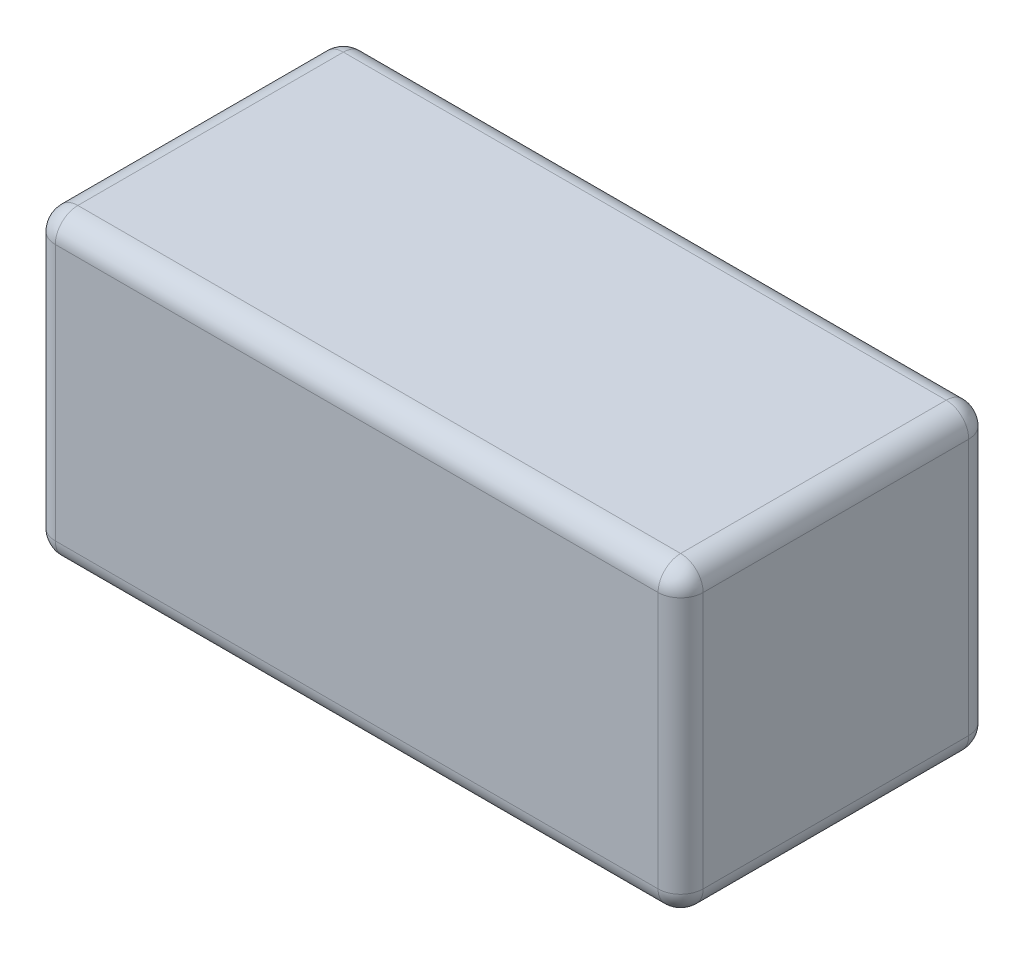
ISO-10303-21;
HEADER;
FILE_DESCRIPTION(('STEP AP214'),'2;1');
FILE_NAME('part.step','',(''),(''),'','','');
FILE_SCHEMA(('AUTOMOTIVE_DESIGN { 1 0 10303 214 1 1 1 1 }'));
ENDSEC;
DATA;
#1=APPLICATION_CONTEXT('core data for automotive mechanical design processes');
#2=APPLICATION_PROTOCOL_DEFINITION('international standard','automotive_design',2000,#1);
#3=PRODUCT_CONTEXT('',#1,'mechanical');
#4=PRODUCT('Part','Part','',(#3));
#5=PRODUCT_RELATED_PRODUCT_CATEGORY('part','',(#4));
#6=PRODUCT_DEFINITION_FORMATION('','',#4);
#7=PRODUCT_DEFINITION_CONTEXT('part definition',#1,'design');
#8=PRODUCT_DEFINITION('design','',#6,#7);
#9=PRODUCT_DEFINITION_SHAPE('','',#8);
#10=(LENGTH_UNIT() NAMED_UNIT(*) SI_UNIT(.MILLI.,.METRE.));
#11=(NAMED_UNIT(*) PLANE_ANGLE_UNIT() SI_UNIT($,.RADIAN.));
#12=(NAMED_UNIT(*) SI_UNIT($,.STERADIAN.) SOLID_ANGLE_UNIT());
#13=UNCERTAINTY_MEASURE_WITH_UNIT(LENGTH_MEASURE(1.E-05),#10,'distance_accuracy_value','');
#14=(GEOMETRIC_REPRESENTATION_CONTEXT(3) GLOBAL_UNCERTAINTY_ASSIGNED_CONTEXT((#13)) GLOBAL_UNIT_ASSIGNED_CONTEXT((#10,
#11,#12)) REPRESENTATION_CONTEXT('',''));
#15=CARTESIAN_POINT('',(0.,0.,0.));
#16=DIRECTION('',(0.,0.,1.));
#17=DIRECTION('',(1.,0.,0.));
#18=AXIS2_PLACEMENT_3D('',#15,#16,#17);
#19=CARTESIAN_POINT('',(-36.5,-17.,35.));
#20=DIRECTION('',(1.,0.,0.));
#21=DIRECTION('',(0.,0.,-1.));
#22=AXIS2_PLACEMENT_3D('',#19,#20,#21);
#23=PLANE('',#22);
#24=DIRECTION('',(0.,0.,-1.));
#25=VECTOR('',#24,1.);
#26=CARTESIAN_POINT('',(-36.5,14.46,35.));
#27=LINE('',#26,#25);
#28=CARTESIAN_POINT('',(-36.5,14.46,32.46));
#29=VERTEX_POINT('',#28);
#30=CARTESIAN_POINT('',(-36.5,14.46,2.54));
#31=VERTEX_POINT('',#30);
#32=EDGE_CURVE('E125',#29,#31,#27,.T.);
#33=ORIENTED_EDGE('',*,*,#32,.T.);
#34=DIRECTION('',(0.,-1.,0.));
#35=VECTOR('',#34,1.);
#36=CARTESIAN_POINT('',(-36.5,-17.,2.54));
#37=LINE('',#36,#35);
#38=CARTESIAN_POINT('',(-36.5,-14.46,2.54));
#39=VERTEX_POINT('',#38);
#40=EDGE_CURVE('E161',#31,#39,#37,.T.);
#41=ORIENTED_EDGE('',*,*,#40,.T.);
#42=DIRECTION('',(0.,0.,-1.));
#43=VECTOR('',#42,1.);
#44=CARTESIAN_POINT('',(-36.5,-14.46,35.));
#45=LINE('',#44,#43);
#46=CARTESIAN_POINT('',(-36.5,-14.46,32.46));
#47=VERTEX_POINT('',#46);
#48=EDGE_CURVE('E128',#39,#47,#45,.F.);
#49=ORIENTED_EDGE('',*,*,#48,.T.);
#50=DIRECTION('',(0.,-1.,0.));
#51=VECTOR('',#50,1.);
#52=CARTESIAN_POINT('',(-36.5,17.,32.46));
#53=LINE('',#52,#51);
#54=EDGE_CURVE('E121',#47,#29,#53,.F.);
#55=ORIENTED_EDGE('',*,*,#54,.T.);
#56=EDGE_LOOP('',(#33,#41,#49,#55));
#57=FACE_BOUND('',#56,.T.);
#58=ADVANCED_FACE('F34',(#57),#23,.F.);
#59=CARTESIAN_POINT('',(36.5,-17.,35.));
#60=DIRECTION('',(0.,1.,0.));
#61=DIRECTION('',(-1.,0.,0.));
#62=AXIS2_PLACEMENT_3D('',#59,#60,#61);
#63=PLANE('',#62);
#64=DIRECTION('',(1.,0.,0.));
#65=VECTOR('',#64,1.);
#66=CARTESIAN_POINT('',(-36.5,-17.,32.46));
#67=LINE('',#66,#65);
#68=CARTESIAN_POINT('',(33.96,-17.,32.46));
#69=VERTEX_POINT('',#68);
#70=CARTESIAN_POINT('',(-33.96,-17.,32.46));
#71=VERTEX_POINT('',#70);
#72=EDGE_CURVE('E172',#69,#71,#67,.F.);
#73=ORIENTED_EDGE('',*,*,#72,.T.);
#74=DIRECTION('',(0.,0.,-1.));
#75=VECTOR('',#74,1.);
#76=CARTESIAN_POINT('',(-33.96,-17.,35.));
#77=LINE('',#76,#75);
#78=CARTESIAN_POINT('',(-33.96,-17.,2.54));
#79=VERTEX_POINT('',#78);
#80=EDGE_CURVE('E178',#71,#79,#77,.T.);
#81=ORIENTED_EDGE('',*,*,#80,.T.);
#82=DIRECTION('',(1.,0.,0.));
#83=VECTOR('',#82,1.);
#84=CARTESIAN_POINT('',(36.5,-17.,2.54));
#85=LINE('',#84,#83);
#86=CARTESIAN_POINT('',(33.96,-17.,2.54));
#87=VERTEX_POINT('',#86);
#88=EDGE_CURVE('E176',#79,#87,#85,.T.);
#89=ORIENTED_EDGE('',*,*,#88,.T.);
#90=DIRECTION('',(0.,0.,-1.));
#91=VECTOR('',#90,1.);
#92=CARTESIAN_POINT('',(33.96,-17.,35.));
#93=LINE('',#92,#91);
#94=EDGE_CURVE('E174',#87,#69,#93,.F.);
#95=ORIENTED_EDGE('',*,*,#94,.T.);
#96=EDGE_LOOP('',(#73,#81,#89,#95));
#97=FACE_BOUND('',#96,.T.);
#98=ADVANCED_FACE('F265',(#97),#63,.F.);
#99=CARTESIAN_POINT('',(36.5,-17.,35.));
#100=DIRECTION('',(-1.,0.,0.));
#101=DIRECTION('',(0.,0.,1.));
#102=AXIS2_PLACEMENT_3D('',#99,#100,#101);
#103=PLANE('',#102);
#104=DIRECTION('',(0.,1.,0.));
#105=VECTOR('',#104,1.);
#106=CARTESIAN_POINT('',(36.5,-17.,32.46));
#107=LINE('',#106,#105);
#108=CARTESIAN_POINT('',(36.5,14.46,32.46));
#109=VERTEX_POINT('',#108);
#110=CARTESIAN_POINT('',(36.5,-14.46,32.46));
#111=VERTEX_POINT('',#110);
#112=EDGE_CURVE('E183',#109,#111,#107,.F.);
#113=ORIENTED_EDGE('',*,*,#112,.T.);
#114=DIRECTION('',(0.,0.,-1.));
#115=VECTOR('',#114,1.);
#116=CARTESIAN_POINT('',(36.5,-14.46,35.));
#117=LINE('',#116,#115);
#118=CARTESIAN_POINT('',(36.5,-14.46,2.54));
#119=VERTEX_POINT('',#118);
#120=EDGE_CURVE('E187',#111,#119,#117,.T.);
#121=ORIENTED_EDGE('',*,*,#120,.T.);
#122=DIRECTION('',(0.,1.,0.));
#123=VECTOR('',#122,1.);
#124=CARTESIAN_POINT('',(36.5,-17.,2.54));
#125=LINE('',#124,#123);
#126=CARTESIAN_POINT('',(36.5,14.46,2.54));
#127=VERTEX_POINT('',#126);
#128=EDGE_CURVE('E185',#119,#127,#125,.T.);
#129=ORIENTED_EDGE('',*,*,#128,.T.);
#130=DIRECTION('',(0.,0.,-1.));
#131=VECTOR('',#130,1.);
#132=CARTESIAN_POINT('',(36.5,14.46,35.));
#133=LINE('',#132,#131);
#134=EDGE_CURVE('E181',#127,#109,#133,.F.);
#135=ORIENTED_EDGE('',*,*,#134,.T.);
#136=EDGE_LOOP('',(#113,#121,#129,#135));
#137=FACE_BOUND('',#136,.T.);
#138=ADVANCED_FACE('F274',(#137),#103,.F.);
#139=CARTESIAN_POINT('',(36.5,17.,35.));
#140=DIRECTION('',(0.,-1.,0.));
#141=DIRECTION('',(1.,0.,0.));
#142=AXIS2_PLACEMENT_3D('',#139,#140,#141);
#143=PLANE('',#142);
#144=DIRECTION('',(-1.,0.,0.));
#145=VECTOR('',#144,1.);
#146=CARTESIAN_POINT('',(36.5,17.,32.46));
#147=LINE('',#146,#145);
#148=CARTESIAN_POINT('',(-33.96,17.,32.46));
#149=VERTEX_POINT('',#148);
#150=CARTESIAN_POINT('',(33.96,17.,32.46));
#151=VERTEX_POINT('',#150);
#152=EDGE_CURVE('E43',#149,#151,#147,.F.);
#153=ORIENTED_EDGE('',*,*,#152,.T.);
#154=DIRECTION('',(0.,0.,-1.));
#155=VECTOR('',#154,1.);
#156=CARTESIAN_POINT('',(33.96,17.,35.));
#157=LINE('',#156,#155);
#158=CARTESIAN_POINT('',(33.96,17.,2.54));
#159=VERTEX_POINT('',#158);
#160=EDGE_CURVE('E11',#151,#159,#157,.T.);
#161=ORIENTED_EDGE('',*,*,#160,.T.);
#162=DIRECTION('',(-1.,0.,0.));
#163=VECTOR('',#162,1.);
#164=CARTESIAN_POINT('',(36.5,17.,2.54));
#165=LINE('',#164,#163);
#166=CARTESIAN_POINT('',(-33.96,17.,2.54));
#167=VERTEX_POINT('',#166);
#168=EDGE_CURVE('E198',#159,#167,#165,.T.);
#169=ORIENTED_EDGE('',*,*,#168,.T.);
#170=DIRECTION('',(0.,0.,-1.));
#171=VECTOR('',#170,1.);
#172=CARTESIAN_POINT('',(-33.96,17.,35.));
#173=LINE('',#172,#171);
#174=EDGE_CURVE('E54',#167,#149,#173,.F.);
#175=ORIENTED_EDGE('',*,*,#174,.T.);
#176=EDGE_LOOP('',(#153,#161,#169,#175));
#177=FACE_BOUND('',#176,.T.);
#178=ADVANCED_FACE('F286',(#177),#143,.F.);
#179=CARTESIAN_POINT('',(0.,0.,35.));
#180=DIRECTION('',(0.,0.,1.));
#181=DIRECTION('',(1.,0.,0.));
#182=AXIS2_PLACEMENT_3D('',#179,#180,#181);
#183=PLANE('',#182);
#184=DIRECTION('',(1.,0.,0.));
#185=VECTOR('',#184,1.);
#186=CARTESIAN_POINT('',(36.5,-14.46,35.));
#187=LINE('',#186,#185);
#188=CARTESIAN_POINT('',(-33.96,-14.46,35.));
#189=VERTEX_POINT('',#188);
#190=CARTESIAN_POINT('',(33.96,-14.46,35.));
#191=VERTEX_POINT('',#190);
#192=EDGE_CURVE('E193',#189,#191,#187,.T.);
#193=ORIENTED_EDGE('',*,*,#192,.T.);
#194=DIRECTION('',(0.,1.,0.));
#195=VECTOR('',#194,1.);
#196=CARTESIAN_POINT('',(33.96,17.,35.));
#197=LINE('',#196,#195);
#198=CARTESIAN_POINT('',(33.96,14.46,35.));
#199=VERTEX_POINT('',#198);
#200=EDGE_CURVE('E195',#191,#199,#197,.T.);
#201=ORIENTED_EDGE('',*,*,#200,.T.);
#202=DIRECTION('',(-1.,0.,0.));
#203=VECTOR('',#202,1.);
#204=CARTESIAN_POINT('',(-36.5,14.46,35.));
#205=LINE('',#204,#203);
#206=CARTESIAN_POINT('',(-33.96,14.46,35.));
#207=VERTEX_POINT('',#206);
#208=EDGE_CURVE('E190',#199,#207,#205,.T.);
#209=ORIENTED_EDGE('',*,*,#208,.T.);
#210=DIRECTION('',(0.,-1.,0.));
#211=VECTOR('',#210,1.);
#212=CARTESIAN_POINT('',(-33.96,-17.,35.));
#213=LINE('',#212,#211);
#214=EDGE_CURVE('E138',#207,#189,#213,.T.);
#215=ORIENTED_EDGE('',*,*,#214,.T.);
#216=EDGE_LOOP('',(#193,#201,#209,#215));
#217=FACE_BOUND('',#216,.T.);
#218=ADVANCED_FACE('F478',(#217),#183,.T.);
#219=CARTESIAN_POINT('',(0.,0.,0.));
#220=DIRECTION('',(0.,0.,1.));
#221=DIRECTION('',(1.,0.,0.));
#222=AXIS2_PLACEMENT_3D('',#219,#220,#221);
#223=PLANE('',#222);
#224=DIRECTION('',(1.,0.,0.));
#225=VECTOR('',#224,1.);
#226=CARTESIAN_POINT('',(0.,-14.46,0.));
#227=LINE('',#226,#225);
#228=CARTESIAN_POINT('',(33.96,-14.46,0.));
#229=VERTEX_POINT('',#228);
#230=CARTESIAN_POINT('',(-33.96,-14.46,0.));
#231=VERTEX_POINT('',#230);
#232=EDGE_CURVE('E167',#229,#231,#227,.F.);
#233=ORIENTED_EDGE('',*,*,#232,.T.);
#234=DIRECTION('',(0.,-1.,0.));
#235=VECTOR('',#234,1.);
#236=CARTESIAN_POINT('',(-33.96,0.,0.));
#237=LINE('',#236,#235);
#238=CARTESIAN_POINT('',(-33.96,14.46,0.));
#239=VERTEX_POINT('',#238);
#240=EDGE_CURVE('E169',#231,#239,#237,.F.);
#241=ORIENTED_EDGE('',*,*,#240,.T.);
#242=DIRECTION('',(-1.,0.,0.));
#243=VECTOR('',#242,1.);
#244=CARTESIAN_POINT('',(0.,14.46,0.));
#245=LINE('',#244,#243);
#246=CARTESIAN_POINT('',(33.96,14.46,0.));
#247=VERTEX_POINT('',#246);
#248=EDGE_CURVE('E163',#239,#247,#245,.F.);
#249=ORIENTED_EDGE('',*,*,#248,.T.);
#250=DIRECTION('',(0.,1.,0.));
#251=VECTOR('',#250,1.);
#252=CARTESIAN_POINT('',(33.96,0.,0.));
#253=LINE('',#252,#251);
#254=EDGE_CURVE('E165',#247,#229,#253,.F.);
#255=ORIENTED_EDGE('',*,*,#254,.T.);
#256=EDGE_LOOP('',(#233,#241,#249,#255));
#257=FACE_BOUND('',#256,.T.);
#258=ADVANCED_FACE('F471',(#257),#223,.F.);
#259=CARTESIAN_POINT('',(33.96,0.,32.46));
#260=DIRECTION('',(0.,-1.,0.));
#261=DIRECTION('',(0.,0.,-1.));
#262=AXIS2_PLACEMENT_3D('',#259,#260,#261);
#263=CYLINDRICAL_SURFACE('',#262,2.54);
#264=CARTESIAN_POINT('',(33.96,14.46,32.46));
#265=DIRECTION('',(0.,1.,0.));
#266=DIRECTION('',(0.,0.,1.));
#267=AXIS2_PLACEMENT_3D('',#264,#265,#266);
#268=CIRCLE('',#267,2.54);
#269=EDGE_CURVE('E38',#199,#109,#268,.T.);
#270=ORIENTED_EDGE('',*,*,#269,.F.);
#271=ORIENTED_EDGE('',*,*,#200,.F.);
#272=CARTESIAN_POINT('',(33.96,-14.46,32.46));
#273=DIRECTION('',(0.,-1.,0.));
#274=DIRECTION('',(0.,0.,-1.));
#275=AXIS2_PLACEMENT_3D('',#272,#273,#274);
#276=CIRCLE('',#275,2.54);
#277=EDGE_CURVE('E158',#111,#191,#276,.T.);
#278=ORIENTED_EDGE('',*,*,#277,.F.);
#279=ORIENTED_EDGE('',*,*,#112,.F.);
#280=EDGE_LOOP('',(#270,#271,#278,#279));
#281=FACE_BOUND('',#280,.T.);
#282=ADVANCED_FACE('F36',(#281),#263,.T.);
#283=CARTESIAN_POINT('',(33.96,14.46,32.46));
#284=DIRECTION('',(0.,0.,1.));
#285=DIRECTION('',(1.,0.,0.));
#286=AXIS2_PLACEMENT_3D('',#283,#284,#285);
#287=SPHERICAL_SURFACE('',#286,2.54);
#288=CARTESIAN_POINT('',(33.96,14.46,32.46));
#289=DIRECTION('',(1.,0.,0.));
#290=DIRECTION('',(0.,0.,-1.));
#291=AXIS2_PLACEMENT_3D('',#288,#289,#290);
#292=CIRCLE('',#291,2.54);
#293=EDGE_CURVE('E244',#199,#151,#292,.F.);
#294=ORIENTED_EDGE('',*,*,#293,.F.);
#295=ORIENTED_EDGE('',*,*,#269,.T.);
#296=CARTESIAN_POINT('',(33.96,14.46,32.46));
#297=DIRECTION('',(0.,0.,1.));
#298=DIRECTION('',(1.,0.,0.));
#299=AXIS2_PLACEMENT_3D('',#296,#297,#298);
#300=CIRCLE('',#299,2.54);
#301=EDGE_CURVE('E246',#151,#109,#300,.F.);
#302=ORIENTED_EDGE('',*,*,#301,.F.);
#303=EDGE_LOOP('',(#294,#295,#302));
#304=FACE_BOUND('',#303,.T.);
#305=ADVANCED_FACE('F280',(#304),#287,.T.);
#306=CARTESIAN_POINT('',(33.96,-14.46,32.46));
#307=DIRECTION('',(0.,0.,1.));
#308=DIRECTION('',(1.,0.,0.));
#309=AXIS2_PLACEMENT_3D('',#306,#307,#308);
#310=SPHERICAL_SURFACE('',#309,2.54);
#311=CARTESIAN_POINT('',(33.96,-14.46,32.46));
#312=DIRECTION('',(0.,0.,1.));
#313=DIRECTION('',(1.,0.,0.));
#314=AXIS2_PLACEMENT_3D('',#311,#312,#313);
#315=CIRCLE('',#314,2.54);
#316=EDGE_CURVE('E238',#111,#69,#315,.F.);
#317=ORIENTED_EDGE('',*,*,#316,.F.);
#318=ORIENTED_EDGE('',*,*,#277,.T.);
#319=CARTESIAN_POINT('',(33.96,-14.46,32.46));
#320=DIRECTION('',(1.,0.,0.));
#321=DIRECTION('',(0.,0.,-1.));
#322=AXIS2_PLACEMENT_3D('',#319,#320,#321);
#323=CIRCLE('',#322,2.54);
#324=EDGE_CURVE('E241',#69,#191,#323,.F.);
#325=ORIENTED_EDGE('',*,*,#324,.F.);
#326=EDGE_LOOP('',(#317,#318,#325));
#327=FACE_BOUND('',#326,.T.);
#328=ADVANCED_FACE('F253',(#327),#310,.T.);
#329=CARTESIAN_POINT('',(33.96,14.46,35.));
#330=DIRECTION('',(0.,0.,-1.));
#331=DIRECTION('',(-1.,0.,0.));
#332=AXIS2_PLACEMENT_3D('',#329,#330,#331);
#333=CYLINDRICAL_SURFACE('',#332,2.54);
#334=ORIENTED_EDGE('',*,*,#301,.T.);
#335=ORIENTED_EDGE('',*,*,#134,.F.);
#336=CARTESIAN_POINT('',(33.96,14.46,2.54));
#337=DIRECTION('',(0.,0.,-1.));
#338=DIRECTION('',(-1.,0.,0.));
#339=AXIS2_PLACEMENT_3D('',#336,#337,#338);
#340=CIRCLE('',#339,2.54);
#341=EDGE_CURVE('E232',#159,#127,#340,.T.);
#342=ORIENTED_EDGE('',*,*,#341,.F.);
#343=ORIENTED_EDGE('',*,*,#160,.F.);
#344=EDGE_LOOP('',(#334,#335,#342,#343));
#345=FACE_BOUND('',#344,.T.);
#346=ADVANCED_FACE('F283',(#345),#333,.T.);
#347=CARTESIAN_POINT('',(0.,14.46,32.46));
#348=DIRECTION('',(1.,0.,0.));
#349=DIRECTION('',(0.,1.,0.));
#350=AXIS2_PLACEMENT_3D('',#347,#348,#349);
#351=CYLINDRICAL_SURFACE('',#350,2.54);
#352=ORIENTED_EDGE('',*,*,#293,.T.);
#353=ORIENTED_EDGE('',*,*,#152,.F.);
#354=CARTESIAN_POINT('',(-33.96,14.46,32.46));
#355=DIRECTION('',(-1.,0.,0.));
#356=DIRECTION('',(0.,0.,1.));
#357=AXIS2_PLACEMENT_3D('',#354,#355,#356);
#358=CIRCLE('',#357,2.54);
#359=EDGE_CURVE('E142',#207,#149,#358,.T.);
#360=ORIENTED_EDGE('',*,*,#359,.F.);
#361=ORIENTED_EDGE('',*,*,#208,.F.);
#362=EDGE_LOOP('',(#352,#353,#360,#361));
#363=FACE_BOUND('',#362,.T.);
#364=ADVANCED_FACE('F435',(#363),#351,.T.);
#365=CARTESIAN_POINT('',(-33.96,0.,32.46));
#366=DIRECTION('',(0.,1.,0.));
#367=DIRECTION('',(0.,0.,1.));
#368=AXIS2_PLACEMENT_3D('',#365,#366,#367);
#369=CYLINDRICAL_SURFACE('',#368,2.54);
#370=CARTESIAN_POINT('',(-33.96,-14.46,32.46));
#371=DIRECTION('',(0.,-1.,0.));
#372=DIRECTION('',(0.,0.,-1.));
#373=AXIS2_PLACEMENT_3D('',#370,#371,#372);
#374=CIRCLE('',#373,2.54);
#375=EDGE_CURVE('E143',#189,#47,#374,.T.);
#376=ORIENTED_EDGE('',*,*,#375,.F.);
#377=ORIENTED_EDGE('',*,*,#214,.F.);
#378=CARTESIAN_POINT('',(-33.96,14.46,32.46));
#379=DIRECTION('',(0.,1.,0.));
#380=DIRECTION('',(0.,0.,1.));
#381=AXIS2_PLACEMENT_3D('',#378,#379,#380);
#382=CIRCLE('',#381,2.54);
#383=EDGE_CURVE('E135',#29,#207,#382,.T.);
#384=ORIENTED_EDGE('',*,*,#383,.F.);
#385=ORIENTED_EDGE('',*,*,#54,.F.);
#386=EDGE_LOOP('',(#376,#377,#384,#385));
#387=FACE_BOUND('',#386,.T.);
#388=ADVANCED_FACE('F137',(#387),#369,.T.);
#389=CARTESIAN_POINT('',(0.,-14.46,32.46));
#390=DIRECTION('',(-1.,0.,0.));
#391=DIRECTION('',(0.,-1.,0.));
#392=AXIS2_PLACEMENT_3D('',#389,#390,#391);
#393=CYLINDRICAL_SURFACE('',#392,2.54);
#394=ORIENTED_EDGE('',*,*,#324,.T.);
#395=ORIENTED_EDGE('',*,*,#192,.F.);
#396=CARTESIAN_POINT('',(-33.96,-14.46,32.46));
#397=DIRECTION('',(-1.,0.,0.));
#398=DIRECTION('',(0.,0.,1.));
#399=AXIS2_PLACEMENT_3D('',#396,#397,#398);
#400=CIRCLE('',#399,2.54);
#401=EDGE_CURVE('E227',#71,#189,#400,.T.);
#402=ORIENTED_EDGE('',*,*,#401,.F.);
#403=ORIENTED_EDGE('',*,*,#72,.F.);
#404=EDGE_LOOP('',(#394,#395,#402,#403));
#405=FACE_BOUND('',#404,.T.);
#406=ADVANCED_FACE('F261',(#405),#393,.T.);
#407=CARTESIAN_POINT('',(33.96,-14.46,35.));
#408=DIRECTION('',(0.,0.,-1.));
#409=DIRECTION('',(-1.,0.,0.));
#410=AXIS2_PLACEMENT_3D('',#407,#408,#409);
#411=CYLINDRICAL_SURFACE('',#410,2.54);
#412=ORIENTED_EDGE('',*,*,#316,.T.);
#413=ORIENTED_EDGE('',*,*,#94,.F.);
#414=CARTESIAN_POINT('',(33.96,-14.46,2.54));
#415=DIRECTION('',(0.,0.,-1.));
#416=DIRECTION('',(-1.,0.,0.));
#417=AXIS2_PLACEMENT_3D('',#414,#415,#416);
#418=CIRCLE('',#417,2.54);
#419=EDGE_CURVE('E224',#119,#87,#418,.T.);
#420=ORIENTED_EDGE('',*,*,#419,.F.);
#421=ORIENTED_EDGE('',*,*,#120,.F.);
#422=EDGE_LOOP('',(#412,#413,#420,#421));
#423=FACE_BOUND('',#422,.T.);
#424=ADVANCED_FACE('F271',(#423),#411,.T.);
#425=CARTESIAN_POINT('',(33.96,-17.,2.54));
#426=DIRECTION('',(0.,1.,0.));
#427=DIRECTION('',(0.,0.,1.));
#428=AXIS2_PLACEMENT_3D('',#425,#426,#427);
#429=CYLINDRICAL_SURFACE('',#428,2.54);
#430=CARTESIAN_POINT('',(33.96,14.46,2.54));
#431=DIRECTION('',(0.,1.,0.));
#432=DIRECTION('',(0.,0.,1.));
#433=AXIS2_PLACEMENT_3D('',#430,#431,#432);
#434=CIRCLE('',#433,2.54);
#435=EDGE_CURVE('E235',#127,#247,#434,.T.);
#436=ORIENTED_EDGE('',*,*,#435,.F.);
#437=ORIENTED_EDGE('',*,*,#128,.F.);
#438=CARTESIAN_POINT('',(33.96,-14.46,2.54));
#439=DIRECTION('',(0.,-1.,0.));
#440=DIRECTION('',(0.,0.,-1.));
#441=AXIS2_PLACEMENT_3D('',#438,#439,#440);
#442=CIRCLE('',#441,2.54);
#443=EDGE_CURVE('E222',#229,#119,#442,.T.);
#444=ORIENTED_EDGE('',*,*,#443,.F.);
#445=ORIENTED_EDGE('',*,*,#254,.F.);
#446=EDGE_LOOP('',(#436,#437,#444,#445));
#447=FACE_BOUND('',#446,.T.);
#448=ADVANCED_FACE('F404',(#447),#429,.T.);
#449=CARTESIAN_POINT('',(33.96,14.46,2.54));
#450=DIRECTION('',(0.,0.,1.));
#451=DIRECTION('',(1.,0.,0.));
#452=AXIS2_PLACEMENT_3D('',#449,#450,#451);
#453=SPHERICAL_SURFACE('',#452,2.54);
#454=ORIENTED_EDGE('',*,*,#341,.T.);
#455=ORIENTED_EDGE('',*,*,#435,.T.);
#456=CARTESIAN_POINT('',(33.96,14.46,2.54));
#457=DIRECTION('',(1.,0.,0.));
#458=DIRECTION('',(0.,0.,-1.));
#459=AXIS2_PLACEMENT_3D('',#456,#457,#458);
#460=CIRCLE('',#459,2.54);
#461=EDGE_CURVE('E149',#159,#247,#460,.F.);
#462=ORIENTED_EDGE('',*,*,#461,.F.);
#463=EDGE_LOOP('',(#454,#455,#462));
#464=FACE_BOUND('',#463,.T.);
#465=ADVANCED_FACE('F316',(#464),#453,.T.);
#466=CARTESIAN_POINT('',(-33.96,14.46,32.46));
#467=DIRECTION('',(0.,0.,1.));
#468=DIRECTION('',(1.,0.,0.));
#469=AXIS2_PLACEMENT_3D('',#466,#467,#468);
#470=SPHERICAL_SURFACE('',#469,2.54);
#471=ORIENTED_EDGE('',*,*,#383,.T.);
#472=ORIENTED_EDGE('',*,*,#359,.T.);
#473=CARTESIAN_POINT('',(-33.96,14.46,32.46));
#474=DIRECTION('',(0.,0.,1.));
#475=DIRECTION('',(1.,0.,0.));
#476=AXIS2_PLACEMENT_3D('',#473,#474,#475);
#477=CIRCLE('',#476,2.54);
#478=EDGE_CURVE('E146',#29,#149,#477,.F.);
#479=ORIENTED_EDGE('',*,*,#478,.F.);
#480=EDGE_LOOP('',(#471,#472,#479));
#481=FACE_BOUND('',#480,.T.);
#482=ADVANCED_FACE('F147',(#481),#470,.T.);
#483=CARTESIAN_POINT('',(-33.96,-14.46,32.46));
#484=DIRECTION('',(0.,0.,1.));
#485=DIRECTION('',(1.,0.,0.));
#486=AXIS2_PLACEMENT_3D('',#483,#484,#485);
#487=SPHERICAL_SURFACE('',#486,2.54);
#488=ORIENTED_EDGE('',*,*,#401,.T.);
#489=ORIENTED_EDGE('',*,*,#375,.T.);
#490=CARTESIAN_POINT('',(-33.96,-14.46,32.46));
#491=DIRECTION('',(0.,0.,1.));
#492=DIRECTION('',(1.,0.,0.));
#493=AXIS2_PLACEMENT_3D('',#490,#491,#492);
#494=CIRCLE('',#493,2.54);
#495=EDGE_CURVE('E150',#71,#47,#494,.F.);
#496=ORIENTED_EDGE('',*,*,#495,.F.);
#497=EDGE_LOOP('',(#488,#489,#496));
#498=FACE_BOUND('',#497,.T.);
#499=ADVANCED_FACE('F306',(#498),#487,.T.);
#500=CARTESIAN_POINT('',(33.96,-14.46,2.54));
#501=DIRECTION('',(0.,0.,1.));
#502=DIRECTION('',(1.,0.,0.));
#503=AXIS2_PLACEMENT_3D('',#500,#501,#502);
#504=SPHERICAL_SURFACE('',#503,2.54);
#505=ORIENTED_EDGE('',*,*,#443,.T.);
#506=ORIENTED_EDGE('',*,*,#419,.T.);
#507=CARTESIAN_POINT('',(33.96,-14.46,2.54));
#508=DIRECTION('',(1.,0.,0.));
#509=DIRECTION('',(0.,0.,-1.));
#510=AXIS2_PLACEMENT_3D('',#507,#508,#509);
#511=CIRCLE('',#510,2.54);
#512=EDGE_CURVE('E215',#229,#87,#511,.F.);
#513=ORIENTED_EDGE('',*,*,#512,.F.);
#514=EDGE_LOOP('',(#505,#506,#513));
#515=FACE_BOUND('',#514,.T.);
#516=ADVANCED_FACE('F308',(#515),#504,.T.);
#517=CARTESIAN_POINT('',(36.5,14.46,2.54));
#518=DIRECTION('',(-1.,0.,0.));
#519=DIRECTION('',(0.,-1.,0.));
#520=AXIS2_PLACEMENT_3D('',#517,#518,#519);
#521=CYLINDRICAL_SURFACE('',#520,2.54);
#522=ORIENTED_EDGE('',*,*,#461,.T.);
#523=ORIENTED_EDGE('',*,*,#248,.F.);
#524=CARTESIAN_POINT('',(-33.96,14.46,2.54));
#525=DIRECTION('',(-1.,0.,0.));
#526=DIRECTION('',(0.,0.,1.));
#527=AXIS2_PLACEMENT_3D('',#524,#525,#526);
#528=CIRCLE('',#527,2.54);
#529=EDGE_CURVE('E212',#167,#239,#528,.T.);
#530=ORIENTED_EDGE('',*,*,#529,.F.);
#531=ORIENTED_EDGE('',*,*,#168,.F.);
#532=EDGE_LOOP('',(#522,#523,#530,#531));
#533=FACE_BOUND('',#532,.T.);
#534=ADVANCED_FACE('F291',(#533),#521,.T.);
#535=CARTESIAN_POINT('',(-33.96,14.46,35.));
#536=DIRECTION('',(0.,0.,-1.));
#537=DIRECTION('',(-1.,0.,0.));
#538=AXIS2_PLACEMENT_3D('',#535,#536,#537);
#539=CYLINDRICAL_SURFACE('',#538,2.54);
#540=ORIENTED_EDGE('',*,*,#478,.T.);
#541=ORIENTED_EDGE('',*,*,#174,.F.);
#542=CARTESIAN_POINT('',(-33.96,14.46,2.54));
#543=DIRECTION('',(0.,0.,-1.));
#544=DIRECTION('',(-1.,0.,0.));
#545=AXIS2_PLACEMENT_3D('',#542,#543,#544);
#546=CIRCLE('',#545,2.54);
#547=EDGE_CURVE('E154',#31,#167,#546,.T.);
#548=ORIENTED_EDGE('',*,*,#547,.F.);
#549=ORIENTED_EDGE('',*,*,#32,.F.);
#550=EDGE_LOOP('',(#540,#541,#548,#549));
#551=FACE_BOUND('',#550,.T.);
#552=ADVANCED_FACE('F152',(#551),#539,.T.);
#553=CARTESIAN_POINT('',(-33.96,-14.46,35.));
#554=DIRECTION('',(0.,0.,-1.));
#555=DIRECTION('',(-1.,0.,0.));
#556=AXIS2_PLACEMENT_3D('',#553,#554,#555);
#557=CYLINDRICAL_SURFACE('',#556,2.54);
#558=ORIENTED_EDGE('',*,*,#495,.T.);
#559=ORIENTED_EDGE('',*,*,#48,.F.);
#560=CARTESIAN_POINT('',(-33.96,-14.46,2.54));
#561=DIRECTION('',(0.,0.,-1.));
#562=DIRECTION('',(-1.,0.,0.));
#563=AXIS2_PLACEMENT_3D('',#560,#561,#562);
#564=CIRCLE('',#563,2.54);
#565=EDGE_CURVE('E208',#79,#39,#564,.T.);
#566=ORIENTED_EDGE('',*,*,#565,.F.);
#567=ORIENTED_EDGE('',*,*,#80,.F.);
#568=EDGE_LOOP('',(#558,#559,#566,#567));
#569=FACE_BOUND('',#568,.T.);
#570=ADVANCED_FACE('F304',(#569),#557,.T.);
#571=CARTESIAN_POINT('',(36.5,-14.46,2.54));
#572=DIRECTION('',(1.,0.,0.));
#573=DIRECTION('',(0.,1.,0.));
#574=AXIS2_PLACEMENT_3D('',#571,#572,#573);
#575=CYLINDRICAL_SURFACE('',#574,2.54);
#576=ORIENTED_EDGE('',*,*,#512,.T.);
#577=ORIENTED_EDGE('',*,*,#88,.F.);
#578=CARTESIAN_POINT('',(-33.96,-14.46,2.54));
#579=DIRECTION('',(-1.,0.,0.));
#580=DIRECTION('',(0.,0.,1.));
#581=AXIS2_PLACEMENT_3D('',#578,#579,#580);
#582=CIRCLE('',#581,2.54);
#583=EDGE_CURVE('E206',#231,#79,#582,.T.);
#584=ORIENTED_EDGE('',*,*,#583,.F.);
#585=ORIENTED_EDGE('',*,*,#232,.F.);
#586=EDGE_LOOP('',(#576,#577,#584,#585));
#587=FACE_BOUND('',#586,.T.);
#588=ADVANCED_FACE('F332',(#587),#575,.T.);
#589=CARTESIAN_POINT('',(-33.96,14.46,2.54));
#590=DIRECTION('',(0.,0.,1.));
#591=DIRECTION('',(1.,0.,0.));
#592=AXIS2_PLACEMENT_3D('',#589,#590,#591);
#593=SPHERICAL_SURFACE('',#592,2.54);
#594=ORIENTED_EDGE('',*,*,#547,.T.);
#595=ORIENTED_EDGE('',*,*,#529,.T.);
#596=CARTESIAN_POINT('',(-33.96,14.46,2.54));
#597=DIRECTION('',(0.,1.,0.));
#598=DIRECTION('',(0.,0.,1.));
#599=AXIS2_PLACEMENT_3D('',#596,#597,#598);
#600=CIRCLE('',#599,2.54);
#601=EDGE_CURVE('E204',#31,#239,#600,.F.);
#602=ORIENTED_EDGE('',*,*,#601,.F.);
#603=EDGE_LOOP('',(#594,#595,#602));
#604=FACE_BOUND('',#603,.T.);
#605=ADVANCED_FACE('F293',(#604),#593,.T.);
#606=CARTESIAN_POINT('',(-33.96,-14.46,2.54));
#607=DIRECTION('',(0.,0.,1.));
#608=DIRECTION('',(1.,0.,0.));
#609=AXIS2_PLACEMENT_3D('',#606,#607,#608);
#610=SPHERICAL_SURFACE('',#609,2.54);
#611=ORIENTED_EDGE('',*,*,#583,.T.);
#612=ORIENTED_EDGE('',*,*,#565,.T.);
#613=CARTESIAN_POINT('',(-33.96,-14.46,2.54));
#614=DIRECTION('',(0.,-1.,0.));
#615=DIRECTION('',(0.,0.,-1.));
#616=AXIS2_PLACEMENT_3D('',#613,#614,#615);
#617=CIRCLE('',#616,2.54);
#618=EDGE_CURVE('E202',#231,#39,#617,.F.);
#619=ORIENTED_EDGE('',*,*,#618,.F.);
#620=EDGE_LOOP('',(#611,#612,#619));
#621=FACE_BOUND('',#620,.T.);
#622=ADVANCED_FACE('F301',(#621),#610,.T.);
#623=CARTESIAN_POINT('',(-33.96,-17.,2.54));
#624=DIRECTION('',(0.,-1.,0.));
#625=DIRECTION('',(0.,0.,-1.));
#626=AXIS2_PLACEMENT_3D('',#623,#624,#625);
#627=CYLINDRICAL_SURFACE('',#626,2.54);
#628=ORIENTED_EDGE('',*,*,#601,.T.);
#629=ORIENTED_EDGE('',*,*,#240,.F.);
#630=ORIENTED_EDGE('',*,*,#618,.T.);
#631=ORIENTED_EDGE('',*,*,#40,.F.);
#632=EDGE_LOOP('',(#628,#629,#630,#631));
#633=FACE_BOUND('',#632,.T.);
#634=ADVANCED_FACE('F297',(#633),#627,.T.);
#635=CLOSED_SHELL('',(#58,#98,#138,#178,#218,#258,#282,#305,#328,#346,#364,#388,#406,#424,#448,
#465,#482,#499,#516,#534,#552,#570,#588,#605,#622,#634));
#636=MANIFOLD_SOLID_BREP('B2',#635);
#637=ADVANCED_BREP_SHAPE_REPRESENTATION('',(#18,#636),#14);
#638=SHAPE_DEFINITION_REPRESENTATION(#9,#637);
ENDSEC;
END-ISO-10303-21;
